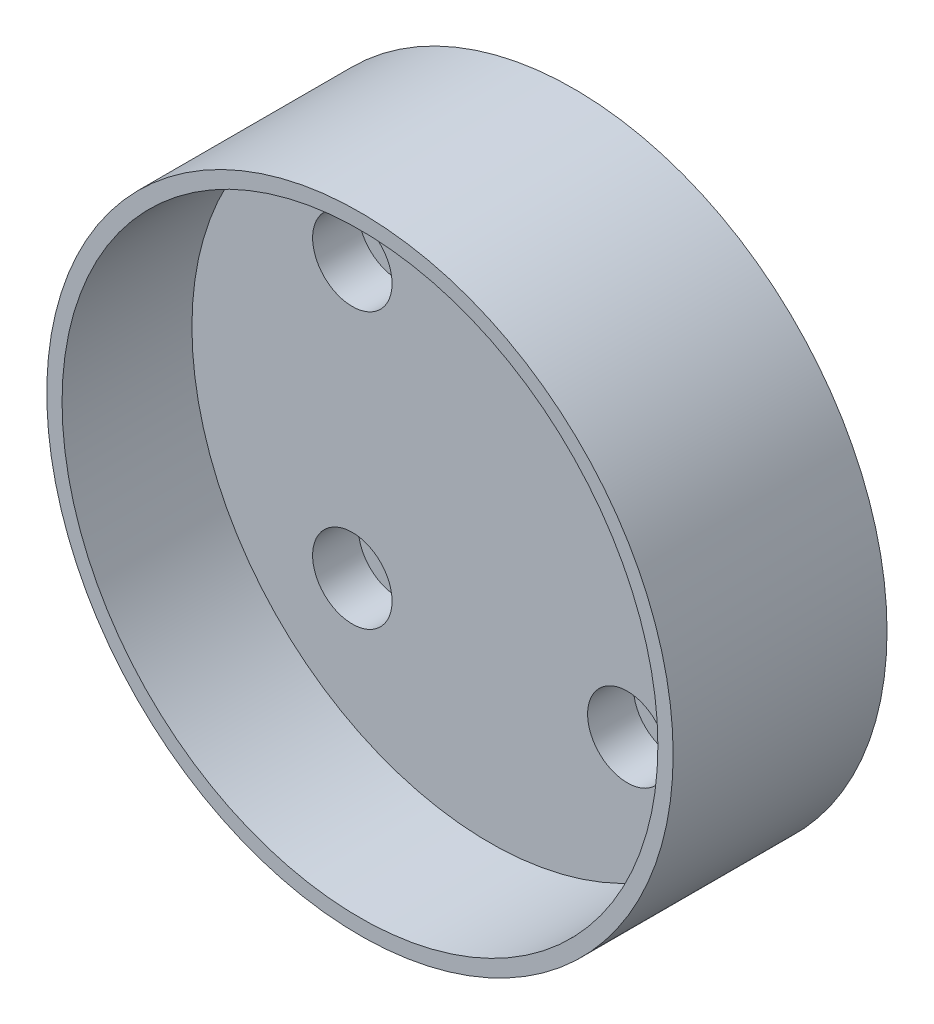
ISO-10303-21;
HEADER;
FILE_DESCRIPTION(('STEP AP214'),'2;1');
FILE_NAME('part.step','',(''),(''),'','','');
FILE_SCHEMA(('AUTOMOTIVE_DESIGN { 1 0 10303 214 1 1 1 1 }'));
ENDSEC;
DATA;
#1=APPLICATION_CONTEXT('core data for automotive mechanical design processes');
#2=APPLICATION_PROTOCOL_DEFINITION('international standard','automotive_design',2000,#1);
#3=PRODUCT_CONTEXT('',#1,'mechanical');
#4=PRODUCT('Part','Part','',(#3));
#5=PRODUCT_RELATED_PRODUCT_CATEGORY('part','',(#4));
#6=PRODUCT_DEFINITION_FORMATION('','',#4);
#7=PRODUCT_DEFINITION_CONTEXT('part definition',#1,'design');
#8=PRODUCT_DEFINITION('design','',#6,#7);
#9=PRODUCT_DEFINITION_SHAPE('','',#8);
#10=(LENGTH_UNIT() NAMED_UNIT(*) SI_UNIT(.MILLI.,.METRE.));
#11=(NAMED_UNIT(*) PLANE_ANGLE_UNIT() SI_UNIT($,.RADIAN.));
#12=(NAMED_UNIT(*) SI_UNIT($,.STERADIAN.) SOLID_ANGLE_UNIT());
#13=UNCERTAINTY_MEASURE_WITH_UNIT(LENGTH_MEASURE(1.E-05),#10,'distance_accuracy_value','');
#14=(GEOMETRIC_REPRESENTATION_CONTEXT(3) GLOBAL_UNCERTAINTY_ASSIGNED_CONTEXT((#13)) GLOBAL_UNIT_ASSIGNED_CONTEXT((#10,
#11,#12)) REPRESENTATION_CONTEXT('',''));
#15=CARTESIAN_POINT('',(0.,0.,0.));
#16=DIRECTION('',(0.,0.,1.));
#17=DIRECTION('',(1.,0.,0.));
#18=AXIS2_PLACEMENT_3D('',#15,#16,#17);
#19=CARTESIAN_POINT('',(18.,-18.,28.));
#20=DIRECTION('',(0.,0.,-1.));
#21=DIRECTION('',(-1.,0.,0.));
#22=AXIS2_PLACEMENT_3D('',#19,#20,#21);
#23=CYLINDRICAL_SURFACE('',#22,2.75);
#24=CARTESIAN_POINT('',(18.,-18.,0.));
#25=DIRECTION('',(0.,0.,-1.));
#26=DIRECTION('',(-1.,0.,0.));
#27=AXIS2_PLACEMENT_3D('',#24,#25,#26);
#28=CIRCLE('',#27,2.75);
#29=CARTESIAN_POINT('',(15.25,-18.,0.));
#30=VERTEX_POINT('',#29);
#31=EDGE_CURVE('E94',#30,#30,#28,.T.);
#32=ORIENTED_EDGE('',*,*,#31,.T.);
#33=EDGE_LOOP('',(#32));
#34=FACE_BOUND('',#33,.T.);
#35=CARTESIAN_POINT('',(18.,-18.,5.));
#36=DIRECTION('',(0.,0.,1.));
#37=DIRECTION('',(1.,0.,0.));
#38=AXIS2_PLACEMENT_3D('',#35,#36,#37);
#39=CIRCLE('',#38,2.75);
#40=CARTESIAN_POINT('',(20.75,-18.,5.));
#41=VERTEX_POINT('',#40);
#42=EDGE_CURVE('E47',#41,#41,#39,.F.);
#43=ORIENTED_EDGE('',*,*,#42,.F.);
#44=EDGE_LOOP('',(#43));
#45=FACE_BOUND('',#44,.T.);
#46=ADVANCED_FACE('F43',(#34,#45),#23,.F.);
#47=CARTESIAN_POINT('',(-18.,-18.,28.));
#48=DIRECTION('',(0.,0.,-1.));
#49=DIRECTION('',(-1.,0.,0.));
#50=AXIS2_PLACEMENT_3D('',#47,#48,#49);
#51=CYLINDRICAL_SURFACE('',#50,2.75);
#52=CARTESIAN_POINT('',(-18.,-18.,0.));
#53=DIRECTION('',(0.,0.,-1.));
#54=DIRECTION('',(-1.,0.,0.));
#55=AXIS2_PLACEMENT_3D('',#52,#53,#54);
#56=CIRCLE('',#55,2.75);
#57=CARTESIAN_POINT('',(-20.75,-18.,0.));
#58=VERTEX_POINT('',#57);
#59=EDGE_CURVE('E90',#58,#58,#56,.T.);
#60=ORIENTED_EDGE('',*,*,#59,.T.);
#61=EDGE_LOOP('',(#60));
#62=FACE_BOUND('',#61,.T.);
#63=CARTESIAN_POINT('',(-18.,-18.,5.));
#64=DIRECTION('',(0.,0.,1.));
#65=DIRECTION('',(1.,0.,0.));
#66=AXIS2_PLACEMENT_3D('',#63,#64,#65);
#67=CIRCLE('',#66,2.75);
#68=CARTESIAN_POINT('',(-15.25,-18.,5.));
#69=VERTEX_POINT('',#68);
#70=EDGE_CURVE('E72',#69,#69,#67,.F.);
#71=ORIENTED_EDGE('',*,*,#70,.F.);
#72=EDGE_LOOP('',(#71));
#73=FACE_BOUND('',#72,.T.);
#74=ADVANCED_FACE('F121',(#62,#73),#51,.F.);
#75=CARTESIAN_POINT('',(-18.,18.,28.));
#76=DIRECTION('',(0.,0.,-1.));
#77=DIRECTION('',(-1.,0.,0.));
#78=AXIS2_PLACEMENT_3D('',#75,#76,#77);
#79=CYLINDRICAL_SURFACE('',#78,2.75);
#80=CARTESIAN_POINT('',(-18.,18.,0.));
#81=DIRECTION('',(0.,0.,-1.));
#82=DIRECTION('',(-1.,0.,0.));
#83=AXIS2_PLACEMENT_3D('',#80,#81,#82);
#84=CIRCLE('',#83,2.75);
#85=CARTESIAN_POINT('',(-20.75,18.,0.));
#86=VERTEX_POINT('',#85);
#87=EDGE_CURVE('E84',#86,#86,#84,.T.);
#88=ORIENTED_EDGE('',*,*,#87,.T.);
#89=EDGE_LOOP('',(#88));
#90=FACE_BOUND('',#89,.T.);
#91=CARTESIAN_POINT('',(-18.,18.,5.));
#92=DIRECTION('',(0.,0.,1.));
#93=DIRECTION('',(1.,0.,0.));
#94=AXIS2_PLACEMENT_3D('',#91,#92,#93);
#95=CIRCLE('',#94,2.75);
#96=CARTESIAN_POINT('',(-15.25,18.,5.));
#97=VERTEX_POINT('',#96);
#98=EDGE_CURVE('E68',#97,#97,#95,.F.);
#99=ORIENTED_EDGE('',*,*,#98,.F.);
#100=EDGE_LOOP('',(#99));
#101=FACE_BOUND('',#100,.T.);
#102=ADVANCED_FACE('F127',(#90,#101),#79,.F.);
#103=CARTESIAN_POINT('',(18.,18.,28.));
#104=DIRECTION('',(0.,0.,-1.));
#105=DIRECTION('',(-1.,0.,0.));
#106=AXIS2_PLACEMENT_3D('',#103,#104,#105);
#107=CYLINDRICAL_SURFACE('',#106,2.75);
#108=CARTESIAN_POINT('',(18.,18.,0.));
#109=DIRECTION('',(0.,0.,-1.));
#110=DIRECTION('',(-1.,0.,0.));
#111=AXIS2_PLACEMENT_3D('',#108,#109,#110);
#112=CIRCLE('',#111,2.75);
#113=CARTESIAN_POINT('',(15.25,18.,0.));
#114=VERTEX_POINT('',#113);
#115=EDGE_CURVE('E79',#114,#114,#112,.T.);
#116=ORIENTED_EDGE('',*,*,#115,.T.);
#117=EDGE_LOOP('',(#116));
#118=FACE_BOUND('',#117,.T.);
#119=CARTESIAN_POINT('',(18.,18.,5.));
#120=DIRECTION('',(0.,0.,1.));
#121=DIRECTION('',(1.,0.,0.));
#122=AXIS2_PLACEMENT_3D('',#119,#120,#121);
#123=CIRCLE('',#122,2.75);
#124=CARTESIAN_POINT('',(20.75,18.,5.));
#125=VERTEX_POINT('',#124);
#126=EDGE_CURVE('E64',#125,#125,#123,.F.);
#127=ORIENTED_EDGE('',*,*,#126,.F.);
#128=EDGE_LOOP('',(#127));
#129=FACE_BOUND('',#128,.T.);
#130=ADVANCED_FACE('F117',(#118,#129),#107,.F.);
#131=CARTESIAN_POINT('',(0.,0.,28.));
#132=DIRECTION('',(0.,0.,-1.));
#133=DIRECTION('',(-1.,0.,0.));
#134=AXIS2_PLACEMENT_3D('',#131,#132,#133);
#135=CYLINDRICAL_SURFACE('',#134,41.);
#136=CARTESIAN_POINT('',(0.,0.,28.));
#137=DIRECTION('',(0.,0.,1.));
#138=DIRECTION('',(1.,0.,0.));
#139=AXIS2_PLACEMENT_3D('',#136,#137,#138);
#140=CIRCLE('',#139,41.);
#141=CARTESIAN_POINT('',(41.,0.,28.));
#142=VERTEX_POINT('',#141);
#143=EDGE_CURVE('E10',#142,#142,#140,.T.);
#144=ORIENTED_EDGE('',*,*,#143,.F.);
#145=EDGE_LOOP('',(#144));
#146=FACE_BOUND('',#145,.T.);
#147=CARTESIAN_POINT('',(0.,0.,0.));
#148=DIRECTION('',(0.,0.,1.));
#149=DIRECTION('',(1.,0.,0.));
#150=AXIS2_PLACEMENT_3D('',#147,#148,#149);
#151=CIRCLE('',#150,41.);
#152=CARTESIAN_POINT('',(41.,0.,0.));
#153=VERTEX_POINT('',#152);
#154=EDGE_CURVE('E52',#153,#153,#151,.T.);
#155=ORIENTED_EDGE('',*,*,#154,.T.);
#156=EDGE_LOOP('',(#155));
#157=FACE_BOUND('',#156,.T.);
#158=ADVANCED_FACE('F45',(#146,#157),#135,.T.);
#159=CARTESIAN_POINT('',(0.,0.,28.));
#160=DIRECTION('',(0.,0.,1.));
#161=DIRECTION('',(1.,0.,0.));
#162=AXIS2_PLACEMENT_3D('',#159,#160,#161);
#163=PLANE('',#162);
#164=CARTESIAN_POINT('',(0.,0.,28.));
#165=DIRECTION('',(0.,0.,1.));
#166=DIRECTION('',(1.,0.,0.));
#167=AXIS2_PLACEMENT_3D('',#164,#165,#166);
#168=CIRCLE('',#167,39.);
#169=CARTESIAN_POINT('',(39.,0.,28.));
#170=VERTEX_POINT('',#169);
#171=EDGE_CURVE('E61',#170,#170,#168,.T.);
#172=ORIENTED_EDGE('',*,*,#171,.F.);
#173=EDGE_LOOP('',(#172));
#174=FACE_BOUND('',#173,.T.);
#175=ORIENTED_EDGE('',*,*,#143,.T.);
#176=EDGE_LOOP('',(#175));
#177=FACE_BOUND('',#176,.T.);
#178=ADVANCED_FACE('F107',(#174,#177),#163,.T.);
#179=CARTESIAN_POINT('',(0.,0.,0.));
#180=DIRECTION('',(0.,0.,1.));
#181=DIRECTION('',(1.,0.,0.));
#182=AXIS2_PLACEMENT_3D('',#179,#180,#181);
#183=PLANE('',#182);
#184=ORIENTED_EDGE('',*,*,#115,.F.);
#185=EDGE_LOOP('',(#184));
#186=FACE_BOUND('',#185,.T.);
#187=ORIENTED_EDGE('',*,*,#87,.F.);
#188=EDGE_LOOP('',(#187));
#189=FACE_BOUND('',#188,.T.);
#190=ORIENTED_EDGE('',*,*,#59,.F.);
#191=EDGE_LOOP('',(#190));
#192=FACE_BOUND('',#191,.T.);
#193=ORIENTED_EDGE('',*,*,#31,.F.);
#194=EDGE_LOOP('',(#193));
#195=FACE_BOUND('',#194,.T.);
#196=ORIENTED_EDGE('',*,*,#154,.F.);
#197=EDGE_LOOP('',(#196));
#198=FACE_BOUND('',#197,.T.);
#199=ADVANCED_FACE('F109',(#186,#189,#192,#195,#198),#183,.F.);
#200=CARTESIAN_POINT('',(0.,0.,11.));
#201=DIRECTION('',(0.,0.,1.));
#202=DIRECTION('',(1.,0.,0.));
#203=AXIS2_PLACEMENT_3D('',#200,#201,#202);
#204=CYLINDRICAL_SURFACE('',#203,39.);
#205=CARTESIAN_POINT('',(0.,0.,11.));
#206=DIRECTION('',(0.,0.,1.));
#207=DIRECTION('',(1.,0.,0.));
#208=AXIS2_PLACEMENT_3D('',#205,#206,#207);
#209=CIRCLE('',#208,39.);
#210=CARTESIAN_POINT('',(39.,0.,11.));
#211=VERTEX_POINT('',#210);
#212=EDGE_CURVE('E58',#211,#211,#209,.T.);
#213=ORIENTED_EDGE('',*,*,#212,.F.);
#214=EDGE_LOOP('',(#213));
#215=FACE_BOUND('',#214,.T.);
#216=ORIENTED_EDGE('',*,*,#171,.T.);
#217=EDGE_LOOP('',(#216));
#218=FACE_BOUND('',#217,.T.);
#219=ADVANCED_FACE('F105',(#215,#218),#204,.F.);
#220=CARTESIAN_POINT('',(0.,0.,11.));
#221=DIRECTION('',(0.,0.,1.));
#222=DIRECTION('',(1.,0.,0.));
#223=AXIS2_PLACEMENT_3D('',#220,#221,#222);
#224=PLANE('',#223);
#225=CARTESIAN_POINT('',(-18.,-18.,11.));
#226=DIRECTION('',(0.,0.,1.));
#227=DIRECTION('',(1.,0.,0.));
#228=AXIS2_PLACEMENT_3D('',#225,#226,#227);
#229=CIRCLE('',#228,5.2);
#230=CARTESIAN_POINT('',(-12.8,-18.,11.));
#231=VERTEX_POINT('',#230);
#232=EDGE_CURVE('E287',#231,#231,#229,.T.);
#233=ORIENTED_EDGE('',*,*,#232,.F.);
#234=EDGE_LOOP('',(#233));
#235=FACE_BOUND('',#234,.T.);
#236=CARTESIAN_POINT('',(18.,-18.,11.));
#237=DIRECTION('',(0.,0.,1.));
#238=DIRECTION('',(1.,0.,0.));
#239=AXIS2_PLACEMENT_3D('',#236,#237,#238);
#240=CIRCLE('',#239,5.2);
#241=CARTESIAN_POINT('',(23.2,-18.,11.));
#242=VERTEX_POINT('',#241);
#243=EDGE_CURVE('E277',#242,#242,#240,.T.);
#244=ORIENTED_EDGE('',*,*,#243,.F.);
#245=EDGE_LOOP('',(#244));
#246=FACE_BOUND('',#245,.T.);
#247=CARTESIAN_POINT('',(18.,18.,11.));
#248=DIRECTION('',(0.,0.,1.));
#249=DIRECTION('',(1.,0.,0.));
#250=AXIS2_PLACEMENT_3D('',#247,#248,#249);
#251=CIRCLE('',#250,5.2);
#252=CARTESIAN_POINT('',(23.2,18.,11.));
#253=VERTEX_POINT('',#252);
#254=EDGE_CURVE('E285',#253,#253,#251,.T.);
#255=ORIENTED_EDGE('',*,*,#254,.F.);
#256=EDGE_LOOP('',(#255));
#257=FACE_BOUND('',#256,.T.);
#258=CARTESIAN_POINT('',(-18.,18.,11.));
#259=DIRECTION('',(0.,0.,1.));
#260=DIRECTION('',(1.,0.,0.));
#261=AXIS2_PLACEMENT_3D('',#258,#259,#260);
#262=CIRCLE('',#261,5.2);
#263=CARTESIAN_POINT('',(-12.8,18.,11.));
#264=VERTEX_POINT('',#263);
#265=EDGE_CURVE('E301',#264,#264,#262,.T.);
#266=ORIENTED_EDGE('',*,*,#265,.F.);
#267=EDGE_LOOP('',(#266));
#268=FACE_BOUND('',#267,.T.);
#269=ORIENTED_EDGE('',*,*,#212,.T.);
#270=EDGE_LOOP('',(#269));
#271=FACE_BOUND('',#270,.T.);
#272=ADVANCED_FACE('F134',(#235,#246,#257,#268,#271),#224,.T.);
#273=CARTESIAN_POINT('',(18.,18.,5.));
#274=DIRECTION('',(0.,0.,1.));
#275=DIRECTION('',(1.,0.,0.));
#276=AXIS2_PLACEMENT_3D('',#273,#274,#275);
#277=PLANE('',#276);
#278=CARTESIAN_POINT('',(18.,18.,5.));
#279=DIRECTION('',(0.,0.,1.));
#280=DIRECTION('',(1.,0.,0.));
#281=AXIS2_PLACEMENT_3D('',#278,#279,#280);
#282=CIRCLE('',#281,5.2);
#283=CARTESIAN_POINT('',(23.2,18.,5.));
#284=VERTEX_POINT('',#283);
#285=EDGE_CURVE('E280',#284,#284,#282,.T.);
#286=ORIENTED_EDGE('',*,*,#285,.T.);
#287=EDGE_LOOP('',(#286));
#288=FACE_BOUND('',#287,.T.);
#289=ORIENTED_EDGE('',*,*,#126,.T.);
#290=EDGE_LOOP('',(#289));
#291=FACE_BOUND('',#290,.T.);
#292=ADVANCED_FACE('F136',(#288,#291),#277,.T.);
#293=CARTESIAN_POINT('',(18.,18.,5.));
#294=DIRECTION('',(0.,0.,1.));
#295=DIRECTION('',(1.,0.,0.));
#296=AXIS2_PLACEMENT_3D('',#293,#294,#295);
#297=CYLINDRICAL_SURFACE('',#296,5.2);
#298=ORIENTED_EDGE('',*,*,#285,.F.);
#299=EDGE_LOOP('',(#298));
#300=FACE_BOUND('',#299,.T.);
#301=ORIENTED_EDGE('',*,*,#254,.T.);
#302=EDGE_LOOP('',(#301));
#303=FACE_BOUND('',#302,.T.);
#304=ADVANCED_FACE('F196',(#300,#303),#297,.F.);
#305=CARTESIAN_POINT('',(-18.,18.,5.));
#306=DIRECTION('',(0.,0.,1.));
#307=DIRECTION('',(1.,0.,0.));
#308=AXIS2_PLACEMENT_3D('',#305,#306,#307);
#309=PLANE('',#308);
#310=CARTESIAN_POINT('',(-18.,18.,5.));
#311=DIRECTION('',(0.,0.,1.));
#312=DIRECTION('',(1.,0.,0.));
#313=AXIS2_PLACEMENT_3D('',#310,#311,#312);
#314=CIRCLE('',#313,5.2);
#315=CARTESIAN_POINT('',(-12.8,18.,5.));
#316=VERTEX_POINT('',#315);
#317=EDGE_CURVE('E69',#316,#316,#314,.T.);
#318=ORIENTED_EDGE('',*,*,#317,.T.);
#319=EDGE_LOOP('',(#318));
#320=FACE_BOUND('',#319,.T.);
#321=ORIENTED_EDGE('',*,*,#98,.T.);
#322=EDGE_LOOP('',(#321));
#323=FACE_BOUND('',#322,.T.);
#324=ADVANCED_FACE('F205',(#320,#323),#309,.T.);
#325=CARTESIAN_POINT('',(-18.,18.,5.));
#326=DIRECTION('',(0.,0.,1.));
#327=DIRECTION('',(1.,0.,0.));
#328=AXIS2_PLACEMENT_3D('',#325,#326,#327);
#329=CYLINDRICAL_SURFACE('',#328,5.2);
#330=ORIENTED_EDGE('',*,*,#317,.F.);
#331=EDGE_LOOP('',(#330));
#332=FACE_BOUND('',#331,.T.);
#333=ORIENTED_EDGE('',*,*,#265,.T.);
#334=EDGE_LOOP('',(#333));
#335=FACE_BOUND('',#334,.T.);
#336=ADVANCED_FACE('F214',(#332,#335),#329,.F.);
#337=CARTESIAN_POINT('',(-18.,-18.,5.));
#338=DIRECTION('',(0.,0.,1.));
#339=DIRECTION('',(1.,0.,0.));
#340=AXIS2_PLACEMENT_3D('',#337,#338,#339);
#341=PLANE('',#340);
#342=CARTESIAN_POINT('',(-18.,-18.,5.));
#343=DIRECTION('',(0.,0.,1.));
#344=DIRECTION('',(1.,0.,0.));
#345=AXIS2_PLACEMENT_3D('',#342,#343,#344);
#346=CIRCLE('',#345,5.2);
#347=CARTESIAN_POINT('',(-12.8,-18.,5.));
#348=VERTEX_POINT('',#347);
#349=EDGE_CURVE('E294',#348,#348,#346,.T.);
#350=ORIENTED_EDGE('',*,*,#349,.T.);
#351=EDGE_LOOP('',(#350));
#352=FACE_BOUND('',#351,.T.);
#353=ORIENTED_EDGE('',*,*,#70,.T.);
#354=EDGE_LOOP('',(#353));
#355=FACE_BOUND('',#354,.T.);
#356=ADVANCED_FACE('F223',(#352,#355),#341,.T.);
#357=CARTESIAN_POINT('',(-18.,-18.,5.));
#358=DIRECTION('',(0.,0.,1.));
#359=DIRECTION('',(1.,0.,0.));
#360=AXIS2_PLACEMENT_3D('',#357,#358,#359);
#361=CYLINDRICAL_SURFACE('',#360,5.2);
#362=ORIENTED_EDGE('',*,*,#349,.F.);
#363=EDGE_LOOP('',(#362));
#364=FACE_BOUND('',#363,.T.);
#365=ORIENTED_EDGE('',*,*,#232,.T.);
#366=EDGE_LOOP('',(#365));
#367=FACE_BOUND('',#366,.T.);
#368=ADVANCED_FACE('F232',(#364,#367),#361,.F.);
#369=CARTESIAN_POINT('',(18.,-18.,5.));
#370=DIRECTION('',(0.,0.,1.));
#371=DIRECTION('',(1.,0.,0.));
#372=AXIS2_PLACEMENT_3D('',#369,#370,#371);
#373=PLANE('',#372);
#374=CARTESIAN_POINT('',(18.,-18.,5.));
#375=DIRECTION('',(0.,0.,1.));
#376=DIRECTION('',(1.,0.,0.));
#377=AXIS2_PLACEMENT_3D('',#374,#375,#376);
#378=CIRCLE('',#377,5.2);
#379=CARTESIAN_POINT('',(23.2,-18.,5.));
#380=VERTEX_POINT('',#379);
#381=EDGE_CURVE('E274',#380,#380,#378,.T.);
#382=ORIENTED_EDGE('',*,*,#381,.T.);
#383=EDGE_LOOP('',(#382));
#384=FACE_BOUND('',#383,.T.);
#385=ORIENTED_EDGE('',*,*,#42,.T.);
#386=EDGE_LOOP('',(#385));
#387=FACE_BOUND('',#386,.T.);
#388=ADVANCED_FACE('F241',(#384,#387),#373,.T.);
#389=CARTESIAN_POINT('',(18.,-18.,5.));
#390=DIRECTION('',(0.,0.,1.));
#391=DIRECTION('',(1.,0.,0.));
#392=AXIS2_PLACEMENT_3D('',#389,#390,#391);
#393=CYLINDRICAL_SURFACE('',#392,5.2);
#394=ORIENTED_EDGE('',*,*,#381,.F.);
#395=EDGE_LOOP('',(#394));
#396=FACE_BOUND('',#395,.T.);
#397=ORIENTED_EDGE('',*,*,#243,.T.);
#398=EDGE_LOOP('',(#397));
#399=FACE_BOUND('',#398,.T.);
#400=ADVANCED_FACE('F250',(#396,#399),#393,.F.);
#401=CLOSED_SHELL('',(#46,#74,#102,#130,#158,#178,#199,#219,#272,#292,#304,#324,#336,#356,#368,
#388,#400));
#402=MANIFOLD_SOLID_BREP('B2',#401);
#403=ADVANCED_BREP_SHAPE_REPRESENTATION('',(#18,#402),#14);
#404=SHAPE_DEFINITION_REPRESENTATION(#9,#403);
ENDSEC;
END-ISO-10303-21;
